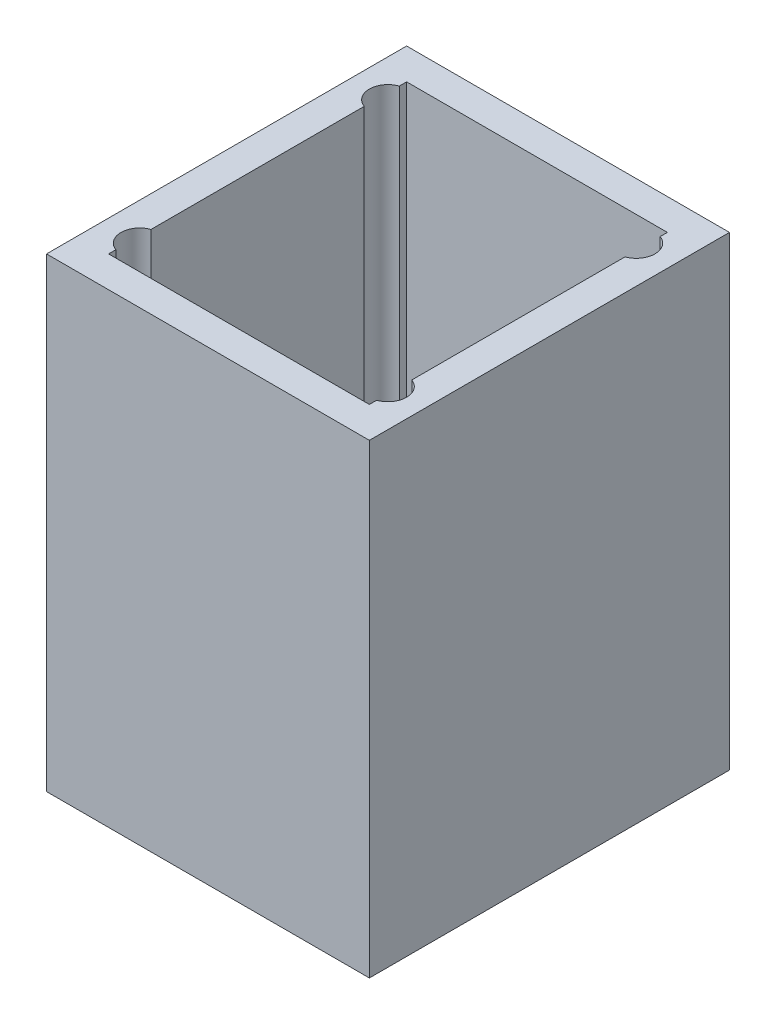
ISO-10303-21;
HEADER;
FILE_DESCRIPTION(('STEP AP214'),'2;1');
FILE_NAME('part.step','',(''),(''),'','','');
FILE_SCHEMA(('AUTOMOTIVE_DESIGN { 1 0 10303 214 1 1 1 1 }'));
ENDSEC;
DATA;
#1=APPLICATION_CONTEXT('core data for automotive mechanical design processes');
#2=APPLICATION_PROTOCOL_DEFINITION('international standard','automotive_design',2000,#1);
#3=PRODUCT_CONTEXT('',#1,'mechanical');
#4=PRODUCT('Part','Part','',(#3));
#5=PRODUCT_RELATED_PRODUCT_CATEGORY('part','',(#4));
#6=PRODUCT_DEFINITION_FORMATION('','',#4);
#7=PRODUCT_DEFINITION_CONTEXT('part definition',#1,'design');
#8=PRODUCT_DEFINITION('design','',#6,#7);
#9=PRODUCT_DEFINITION_SHAPE('','',#8);
#10=(LENGTH_UNIT() NAMED_UNIT(*) SI_UNIT(.MILLI.,.METRE.));
#11=(NAMED_UNIT(*) PLANE_ANGLE_UNIT() SI_UNIT($,.RADIAN.));
#12=(NAMED_UNIT(*) SI_UNIT($,.STERADIAN.) SOLID_ANGLE_UNIT());
#13=UNCERTAINTY_MEASURE_WITH_UNIT(LENGTH_MEASURE(1.E-05),#10,'distance_accuracy_value','');
#14=(GEOMETRIC_REPRESENTATION_CONTEXT(3) GLOBAL_UNCERTAINTY_ASSIGNED_CONTEXT((#13)) GLOBAL_UNIT_ASSIGNED_CONTEXT((#10,
#11,#12)) REPRESENTATION_CONTEXT('',''));
#15=CARTESIAN_POINT('',(0.,0.,0.));
#16=DIRECTION('',(0.,0.,1.));
#17=DIRECTION('',(1.,0.,0.));
#18=AXIS2_PLACEMENT_3D('',#15,#16,#17);
#19=CARTESIAN_POINT('',(0.,5.,0.));
#20=DIRECTION('',(0.,1.,0.));
#21=DIRECTION('',(0.,0.,1.));
#22=AXIS2_PLACEMENT_3D('',#19,#20,#21);
#23=PLANE('',#22);
#24=CARTESIAN_POINT('',(-20.,5.,-20.));
#25=DIRECTION('',(0.,1.,0.));
#26=DIRECTION('',(0.,0.,1.));
#27=AXIS2_PLACEMENT_3D('',#24,#25,#26);
#28=CIRCLE('',#27,3.);
#29=CARTESIAN_POINT('',(-21.,5.,-17.1715728752538));
#30=VERTEX_POINT('',#29);
#31=CARTESIAN_POINT('',(-21.,5.,-22.8284271247462));
#32=VERTEX_POINT('',#31);
#33=EDGE_CURVE('E325',#30,#32,#28,.T.);
#34=ORIENTED_EDGE('',*,*,#33,.F.);
#35=DIRECTION('',(0.,0.,1.));
#36=VECTOR('',#35,1.);
#37=CARTESIAN_POINT('',(-21.,5.,0.));
#38=LINE('',#37,#36);
#39=CARTESIAN_POINT('',(-21.,5.,17.1715728752538));
#40=VERTEX_POINT('',#39);
#41=EDGE_CURVE('E235',#30,#40,#38,.T.);
#42=ORIENTED_EDGE('',*,*,#41,.T.);
#43=CARTESIAN_POINT('',(-20.,5.,20.));
#44=DIRECTION('',(0.,1.,0.));
#45=DIRECTION('',(0.,0.,1.));
#46=AXIS2_PLACEMENT_3D('',#43,#44,#45);
#47=CIRCLE('',#46,3.);
#48=CARTESIAN_POINT('',(-21.,5.,22.8284271247462));
#49=VERTEX_POINT('',#48);
#50=EDGE_CURVE('E319',#49,#40,#47,.T.);
#51=ORIENTED_EDGE('',*,*,#50,.F.);
#52=CARTESIAN_POINT('',(-21.,5.,24.));
#53=VERTEX_POINT('',#52);
#54=EDGE_CURVE('E115',#49,#53,#38,.T.);
#55=ORIENTED_EDGE('',*,*,#54,.T.);
#56=DIRECTION('',(1.,0.,0.));
#57=VECTOR('',#56,1.);
#58=CARTESIAN_POINT('',(0.,5.,24.));
#59=LINE('',#58,#57);
#60=CARTESIAN_POINT('',(21.,5.,24.));
#61=VERTEX_POINT('',#60);
#62=EDGE_CURVE('E120',#53,#61,#59,.T.);
#63=ORIENTED_EDGE('',*,*,#62,.T.);
#64=DIRECTION('',(0.,0.,1.));
#65=VECTOR('',#64,1.);
#66=CARTESIAN_POINT('',(21.,5.,0.));
#67=LINE('',#66,#65);
#68=CARTESIAN_POINT('',(21.,5.,22.8284271247462));
#69=VERTEX_POINT('',#68);
#70=EDGE_CURVE('E270',#69,#61,#67,.T.);
#71=ORIENTED_EDGE('',*,*,#70,.F.);
#72=CARTESIAN_POINT('',(20.,5.,20.));
#73=DIRECTION('',(0.,1.,0.));
#74=DIRECTION('',(0.,0.,1.));
#75=AXIS2_PLACEMENT_3D('',#72,#73,#74);
#76=CIRCLE('',#75,3.);
#77=CARTESIAN_POINT('',(21.,5.,17.1715728752538));
#78=VERTEX_POINT('',#77);
#79=EDGE_CURVE('E313',#78,#69,#76,.T.);
#80=ORIENTED_EDGE('',*,*,#79,.F.);
#81=CARTESIAN_POINT('',(21.,5.,-17.1715728752538));
#82=VERTEX_POINT('',#81);
#83=EDGE_CURVE('E269',#82,#78,#67,.T.);
#84=ORIENTED_EDGE('',*,*,#83,.F.);
#85=CARTESIAN_POINT('',(20.,5.,-20.));
#86=DIRECTION('',(0.,1.,0.));
#87=DIRECTION('',(0.,0.,1.));
#88=AXIS2_PLACEMENT_3D('',#85,#86,#87);
#89=CIRCLE('',#88,3.);
#90=CARTESIAN_POINT('',(21.,5.,-22.8284271247462));
#91=VERTEX_POINT('',#90);
#92=EDGE_CURVE('E307',#91,#82,#89,.T.);
#93=ORIENTED_EDGE('',*,*,#92,.F.);
#94=CARTESIAN_POINT('',(21.,5.,-24.));
#95=VERTEX_POINT('',#94);
#96=EDGE_CURVE('E266',#95,#91,#67,.T.);
#97=ORIENTED_EDGE('',*,*,#96,.F.);
#98=DIRECTION('',(1.,0.,0.));
#99=VECTOR('',#98,1.);
#100=CARTESIAN_POINT('',(0.,5.,-24.));
#101=LINE('',#100,#99);
#102=CARTESIAN_POINT('',(-21.,5.,-24.));
#103=VERTEX_POINT('',#102);
#104=EDGE_CURVE('E263',#103,#95,#101,.T.);
#105=ORIENTED_EDGE('',*,*,#104,.F.);
#106=EDGE_CURVE('E233',#103,#32,#38,.T.);
#107=ORIENTED_EDGE('',*,*,#106,.T.);
#108=EDGE_LOOP('',(#34,#42,#51,#55,#63,#71,#80,#84,#93,#97,#105,#107));
#109=FACE_BOUND('',#108,.T.);
#110=ADVANCED_FACE('F100',(#109),#23,.T.);
#111=CARTESIAN_POINT('',(0.,2.,0.));
#112=DIRECTION('',(0.,1.,0.));
#113=DIRECTION('',(0.,0.,1.));
#114=AXIS2_PLACEMENT_3D('',#111,#112,#113);
#115=PLANE('',#114);
#116=CARTESIAN_POINT('',(-20.,2.,-20.));
#117=DIRECTION('',(0.,1.,0.));
#118=DIRECTION('',(0.,0.,1.));
#119=AXIS2_PLACEMENT_3D('',#116,#117,#118);
#120=CIRCLE('',#119,1.7);
#121=CARTESIAN_POINT('',(-20.,2.,-18.3));
#122=VERTEX_POINT('',#121);
#123=EDGE_CURVE('E349',#122,#122,#120,.T.);
#124=ORIENTED_EDGE('',*,*,#123,.F.);
#125=EDGE_LOOP('',(#124));
#126=FACE_BOUND('',#125,.T.);
#127=CARTESIAN_POINT('',(-20.,2.,-20.));
#128=DIRECTION('',(0.,1.,0.));
#129=DIRECTION('',(0.,0.,1.));
#130=AXIS2_PLACEMENT_3D('',#127,#128,#129);
#131=CIRCLE('',#130,3.);
#132=CARTESIAN_POINT('',(-20.,2.,-17.));
#133=VERTEX_POINT('',#132);
#134=EDGE_CURVE('E322',#133,#133,#131,.T.);
#135=ORIENTED_EDGE('',*,*,#134,.T.);
#136=EDGE_LOOP('',(#135));
#137=FACE_BOUND('',#136,.T.);
#138=ADVANCED_FACE('F387',(#126,#137),#115,.T.);
#139=CARTESIAN_POINT('',(-20.,2.,20.));
#140=DIRECTION('',(0.,1.,0.));
#141=DIRECTION('',(0.,0.,1.));
#142=AXIS2_PLACEMENT_3D('',#139,#140,#141);
#143=CIRCLE('',#142,1.7);
#144=CARTESIAN_POINT('',(-20.,2.,21.7));
#145=VERTEX_POINT('',#144);
#146=EDGE_CURVE('E343',#145,#145,#143,.T.);
#147=ORIENTED_EDGE('',*,*,#146,.F.);
#148=EDGE_LOOP('',(#147));
#149=FACE_BOUND('',#148,.T.);
#150=CARTESIAN_POINT('',(-20.,2.,20.));
#151=DIRECTION('',(0.,1.,0.));
#152=DIRECTION('',(0.,0.,1.));
#153=AXIS2_PLACEMENT_3D('',#150,#151,#152);
#154=CIRCLE('',#153,3.);
#155=CARTESIAN_POINT('',(-20.,2.,23.));
#156=VERTEX_POINT('',#155);
#157=EDGE_CURVE('E316',#156,#156,#154,.T.);
#158=ORIENTED_EDGE('',*,*,#157,.T.);
#159=EDGE_LOOP('',(#158));
#160=FACE_BOUND('',#159,.T.);
#161=ADVANCED_FACE('F392',(#149,#160),#115,.T.);
#162=CARTESIAN_POINT('',(20.,2.,20.));
#163=DIRECTION('',(0.,1.,0.));
#164=DIRECTION('',(0.,0.,-1.));
#165=AXIS2_PLACEMENT_3D('',#162,#163,#164);
#166=CIRCLE('',#165,1.7);
#167=CARTESIAN_POINT('',(20.,2.,18.3));
#168=VERTEX_POINT('',#167);
#169=EDGE_CURVE('E337',#168,#168,#166,.T.);
#170=ORIENTED_EDGE('',*,*,#169,.F.);
#171=EDGE_LOOP('',(#170));
#172=FACE_BOUND('',#171,.T.);
#173=CARTESIAN_POINT('',(20.,2.,20.));
#174=DIRECTION('',(0.,1.,0.));
#175=DIRECTION('',(0.,0.,1.));
#176=AXIS2_PLACEMENT_3D('',#173,#174,#175);
#177=CIRCLE('',#176,3.);
#178=CARTESIAN_POINT('',(20.,2.,23.));
#179=VERTEX_POINT('',#178);
#180=EDGE_CURVE('E310',#179,#179,#177,.T.);
#181=ORIENTED_EDGE('',*,*,#180,.T.);
#182=EDGE_LOOP('',(#181));
#183=FACE_BOUND('',#182,.T.);
#184=ADVANCED_FACE('F415',(#172,#183),#115,.T.);
#185=CARTESIAN_POINT('',(20.,2.,-20.));
#186=DIRECTION('',(0.,1.,0.));
#187=DIRECTION('',(0.,0.,-1.));
#188=AXIS2_PLACEMENT_3D('',#185,#186,#187);
#189=CIRCLE('',#188,1.7);
#190=CARTESIAN_POINT('',(20.,2.,-21.7));
#191=VERTEX_POINT('',#190);
#192=EDGE_CURVE('E331',#191,#191,#189,.T.);
#193=ORIENTED_EDGE('',*,*,#192,.F.);
#194=EDGE_LOOP('',(#193));
#195=FACE_BOUND('',#194,.T.);
#196=CARTESIAN_POINT('',(20.,2.,-20.));
#197=DIRECTION('',(0.,1.,0.));
#198=DIRECTION('',(0.,0.,1.));
#199=AXIS2_PLACEMENT_3D('',#196,#197,#198);
#200=CIRCLE('',#199,3.);
#201=CARTESIAN_POINT('',(20.,2.,-17.));
#202=VERTEX_POINT('',#201);
#203=EDGE_CURVE('E306',#202,#202,#200,.T.);
#204=ORIENTED_EDGE('',*,*,#203,.T.);
#205=EDGE_LOOP('',(#204));
#206=FACE_BOUND('',#205,.T.);
#207=ADVANCED_FACE('F395',(#195,#206),#115,.T.);
#208=CARTESIAN_POINT('',(0.,0.,0.));
#209=DIRECTION('',(0.,1.,0.));
#210=DIRECTION('',(0.,0.,1.));
#211=AXIS2_PLACEMENT_3D('',#208,#209,#210);
#212=PLANE('',#211);
#213=DIRECTION('',(0.,0.,-1.));
#214=VECTOR('',#213,1.);
#215=CARTESIAN_POINT('',(26.,0.,-29.));
#216=LINE('',#215,#214);
#217=CARTESIAN_POINT('',(26.,0.,29.));
#218=VERTEX_POINT('',#217);
#219=CARTESIAN_POINT('',(26.,0.,-29.));
#220=VERTEX_POINT('',#219);
#221=EDGE_CURVE('E217',#218,#220,#216,.T.);
#222=ORIENTED_EDGE('',*,*,#221,.F.);
#223=DIRECTION('',(1.,0.,0.));
#224=VECTOR('',#223,1.);
#225=CARTESIAN_POINT('',(-26.,0.,29.));
#226=LINE('',#225,#224);
#227=CARTESIAN_POINT('',(-26.,0.,29.));
#228=VERTEX_POINT('',#227);
#229=EDGE_CURVE('E359',#228,#218,#226,.T.);
#230=ORIENTED_EDGE('',*,*,#229,.F.);
#231=DIRECTION('',(0.,0.,1.));
#232=VECTOR('',#231,1.);
#233=CARTESIAN_POINT('',(-26.,0.,-29.));
#234=LINE('',#233,#232);
#235=CARTESIAN_POINT('',(-26.,0.,-29.));
#236=VERTEX_POINT('',#235);
#237=EDGE_CURVE('E357',#236,#228,#234,.T.);
#238=ORIENTED_EDGE('',*,*,#237,.F.);
#239=DIRECTION('',(-1.,0.,0.));
#240=VECTOR('',#239,1.);
#241=CARTESIAN_POINT('',(-26.,0.,-29.));
#242=LINE('',#241,#240);
#243=EDGE_CURVE('E355',#220,#236,#242,.T.);
#244=ORIENTED_EDGE('',*,*,#243,.F.);
#245=EDGE_LOOP('',(#222,#230,#238,#244));
#246=FACE_BOUND('',#245,.T.);
#247=CARTESIAN_POINT('',(-20.,0.,-20.));
#248=DIRECTION('',(0.,1.,0.));
#249=DIRECTION('',(0.,0.,1.));
#250=AXIS2_PLACEMENT_3D('',#247,#248,#249);
#251=CIRCLE('',#250,1.7);
#252=CARTESIAN_POINT('',(-20.,0.,-18.3));
#253=VERTEX_POINT('',#252);
#254=EDGE_CURVE('E346',#253,#253,#251,.T.);
#255=ORIENTED_EDGE('',*,*,#254,.T.);
#256=EDGE_LOOP('',(#255));
#257=FACE_BOUND('',#256,.T.);
#258=CARTESIAN_POINT('',(-20.,0.,20.));
#259=DIRECTION('',(0.,1.,0.));
#260=DIRECTION('',(0.,0.,1.));
#261=AXIS2_PLACEMENT_3D('',#258,#259,#260);
#262=CIRCLE('',#261,1.7);
#263=CARTESIAN_POINT('',(-20.,0.,21.7));
#264=VERTEX_POINT('',#263);
#265=EDGE_CURVE('E340',#264,#264,#262,.T.);
#266=ORIENTED_EDGE('',*,*,#265,.T.);
#267=EDGE_LOOP('',(#266));
#268=FACE_BOUND('',#267,.T.);
#269=CARTESIAN_POINT('',(20.,0.,20.));
#270=DIRECTION('',(0.,1.,0.));
#271=DIRECTION('',(0.,0.,-1.));
#272=AXIS2_PLACEMENT_3D('',#269,#270,#271);
#273=CIRCLE('',#272,1.7);
#274=CARTESIAN_POINT('',(20.,0.,18.3));
#275=VERTEX_POINT('',#274);
#276=EDGE_CURVE('E334',#275,#275,#273,.T.);
#277=ORIENTED_EDGE('',*,*,#276,.T.);
#278=EDGE_LOOP('',(#277));
#279=FACE_BOUND('',#278,.T.);
#280=CARTESIAN_POINT('',(20.,0.,-20.));
#281=DIRECTION('',(0.,1.,0.));
#282=DIRECTION('',(0.,0.,-1.));
#283=AXIS2_PLACEMENT_3D('',#280,#281,#282);
#284=CIRCLE('',#283,1.7);
#285=CARTESIAN_POINT('',(20.,0.,-21.7));
#286=VERTEX_POINT('',#285);
#287=EDGE_CURVE('E328',#286,#286,#284,.T.);
#288=ORIENTED_EDGE('',*,*,#287,.T.);
#289=EDGE_LOOP('',(#288));
#290=FACE_BOUND('',#289,.T.);
#291=ADVANCED_FACE('F370',(#246,#257,#268,#279,#290),#212,.F.);
#292=CARTESIAN_POINT('',(26.,2.,-29.));
#293=DIRECTION('',(-1.,0.,0.));
#294=DIRECTION('',(0.,0.,1.));
#295=AXIS2_PLACEMENT_3D('',#292,#293,#294);
#296=PLANE('',#295);
#297=ORIENTED_EDGE('',*,*,#221,.T.);
#298=DIRECTION('',(0.,-1.,0.));
#299=VECTOR('',#298,1.);
#300=CARTESIAN_POINT('',(26.,2.,-29.));
#301=LINE('',#300,#299);
#302=CARTESIAN_POINT('',(26.,75.,-29.));
#303=VERTEX_POINT('',#302);
#304=EDGE_CURVE('E12',#303,#220,#301,.T.);
#305=ORIENTED_EDGE('',*,*,#304,.F.);
#306=DIRECTION('',(0.,0.,-1.));
#307=VECTOR('',#306,1.);
#308=CARTESIAN_POINT('',(26.,75.,0.));
#309=LINE('',#308,#307);
#310=CARTESIAN_POINT('',(26.,75.,29.));
#311=VERTEX_POINT('',#310);
#312=EDGE_CURVE('E215',#311,#303,#309,.T.);
#313=ORIENTED_EDGE('',*,*,#312,.F.);
#314=DIRECTION('',(0.,-1.,0.));
#315=VECTOR('',#314,1.);
#316=CARTESIAN_POINT('',(26.,2.,29.));
#317=LINE('',#316,#315);
#318=EDGE_CURVE('E361',#311,#218,#317,.T.);
#319=ORIENTED_EDGE('',*,*,#318,.T.);
#320=EDGE_LOOP('',(#297,#305,#313,#319));
#321=FACE_BOUND('',#320,.T.);
#322=ADVANCED_FACE('F102',(#321),#296,.F.);
#323=CARTESIAN_POINT('',(-26.,2.,-29.));
#324=DIRECTION('',(0.,0.,1.));
#325=DIRECTION('',(1.,0.,0.));
#326=AXIS2_PLACEMENT_3D('',#323,#324,#325);
#327=PLANE('',#326);
#328=ORIENTED_EDGE('',*,*,#243,.T.);
#329=DIRECTION('',(0.,-1.,0.));
#330=VECTOR('',#329,1.);
#331=CARTESIAN_POINT('',(-26.,2.,-29.));
#332=LINE('',#331,#330);
#333=CARTESIAN_POINT('',(-26.,75.,-29.));
#334=VERTEX_POINT('',#333);
#335=EDGE_CURVE('E108',#334,#236,#332,.T.);
#336=ORIENTED_EDGE('',*,*,#335,.F.);
#337=DIRECTION('',(-1.,0.,0.));
#338=VECTOR('',#337,1.);
#339=CARTESIAN_POINT('',(0.,75.,-29.));
#340=LINE('',#339,#338);
#341=EDGE_CURVE('E220',#303,#334,#340,.T.);
#342=ORIENTED_EDGE('',*,*,#341,.F.);
#343=ORIENTED_EDGE('',*,*,#304,.T.);
#344=EDGE_LOOP('',(#328,#336,#342,#343));
#345=FACE_BOUND('',#344,.T.);
#346=ADVANCED_FACE('F221',(#345),#327,.F.);
#347=CARTESIAN_POINT('',(-26.,2.,-29.));
#348=DIRECTION('',(1.,0.,0.));
#349=DIRECTION('',(0.,0.,-1.));
#350=AXIS2_PLACEMENT_3D('',#347,#348,#349);
#351=PLANE('',#350);
#352=ORIENTED_EDGE('',*,*,#237,.T.);
#353=DIRECTION('',(0.,-1.,0.));
#354=VECTOR('',#353,1.);
#355=CARTESIAN_POINT('',(-26.,2.,29.));
#356=LINE('',#355,#354);
#357=CARTESIAN_POINT('',(-26.,75.,29.));
#358=VERTEX_POINT('',#357);
#359=EDGE_CURVE('E363',#358,#228,#356,.T.);
#360=ORIENTED_EDGE('',*,*,#359,.F.);
#361=DIRECTION('',(0.,0.,1.));
#362=VECTOR('',#361,1.);
#363=CARTESIAN_POINT('',(-26.,75.,0.));
#364=LINE('',#363,#362);
#365=EDGE_CURVE('E226',#334,#358,#364,.T.);
#366=ORIENTED_EDGE('',*,*,#365,.F.);
#367=ORIENTED_EDGE('',*,*,#335,.T.);
#368=EDGE_LOOP('',(#352,#360,#366,#367));
#369=FACE_BOUND('',#368,.T.);
#370=ADVANCED_FACE('F367',(#369),#351,.F.);
#371=CARTESIAN_POINT('',(-26.,2.,29.));
#372=DIRECTION('',(0.,0.,-1.));
#373=DIRECTION('',(-1.,0.,0.));
#374=AXIS2_PLACEMENT_3D('',#371,#372,#373);
#375=PLANE('',#374);
#376=ORIENTED_EDGE('',*,*,#229,.T.);
#377=ORIENTED_EDGE('',*,*,#318,.F.);
#378=DIRECTION('',(1.,0.,0.));
#379=VECTOR('',#378,1.);
#380=CARTESIAN_POINT('',(0.,75.,29.));
#381=LINE('',#380,#379);
#382=EDGE_CURVE('E232',#358,#311,#381,.T.);
#383=ORIENTED_EDGE('',*,*,#382,.F.);
#384=ORIENTED_EDGE('',*,*,#359,.T.);
#385=EDGE_LOOP('',(#376,#377,#383,#384));
#386=FACE_BOUND('',#385,.T.);
#387=ADVANCED_FACE('F373',(#386),#375,.F.);
#388=CARTESIAN_POINT('',(-20.,2.,-20.));
#389=DIRECTION('',(0.,-1.,0.));
#390=DIRECTION('',(0.,0.,-1.));
#391=AXIS2_PLACEMENT_3D('',#388,#389,#390);
#392=CYLINDRICAL_SURFACE('',#391,1.7);
#393=ORIENTED_EDGE('',*,*,#123,.T.);
#394=EDGE_LOOP('',(#393));
#395=FACE_BOUND('',#394,.T.);
#396=ORIENTED_EDGE('',*,*,#254,.F.);
#397=EDGE_LOOP('',(#396));
#398=FACE_BOUND('',#397,.T.);
#399=ADVANCED_FACE('F375',(#395,#398),#392,.F.);
#400=CARTESIAN_POINT('',(-20.,2.,20.));
#401=DIRECTION('',(0.,-1.,0.));
#402=DIRECTION('',(0.,0.,-1.));
#403=AXIS2_PLACEMENT_3D('',#400,#401,#402);
#404=CYLINDRICAL_SURFACE('',#403,1.7);
#405=ORIENTED_EDGE('',*,*,#146,.T.);
#406=EDGE_LOOP('',(#405));
#407=FACE_BOUND('',#406,.T.);
#408=ORIENTED_EDGE('',*,*,#265,.F.);
#409=EDGE_LOOP('',(#408));
#410=FACE_BOUND('',#409,.T.);
#411=ADVANCED_FACE('F381',(#407,#410),#404,.F.);
#412=CARTESIAN_POINT('',(20.,2.,20.));
#413=DIRECTION('',(0.,-1.,0.));
#414=DIRECTION('',(0.,0.,-1.));
#415=AXIS2_PLACEMENT_3D('',#412,#413,#414);
#416=CYLINDRICAL_SURFACE('',#415,1.7);
#417=ORIENTED_EDGE('',*,*,#169,.T.);
#418=EDGE_LOOP('',(#417));
#419=FACE_BOUND('',#418,.T.);
#420=ORIENTED_EDGE('',*,*,#276,.F.);
#421=EDGE_LOOP('',(#420));
#422=FACE_BOUND('',#421,.T.);
#423=ADVANCED_FACE('F403',(#419,#422),#416,.F.);
#424=CARTESIAN_POINT('',(20.,2.,-20.));
#425=DIRECTION('',(0.,-1.,0.));
#426=DIRECTION('',(0.,0.,-1.));
#427=AXIS2_PLACEMENT_3D('',#424,#425,#426);
#428=CYLINDRICAL_SURFACE('',#427,1.7);
#429=ORIENTED_EDGE('',*,*,#192,.T.);
#430=EDGE_LOOP('',(#429));
#431=FACE_BOUND('',#430,.T.);
#432=ORIENTED_EDGE('',*,*,#287,.F.);
#433=EDGE_LOOP('',(#432));
#434=FACE_BOUND('',#433,.T.);
#435=ADVANCED_FACE('F400',(#431,#434),#428,.F.);
#436=CARTESIAN_POINT('',(-20.,5.,-20.));
#437=DIRECTION('',(0.,-1.,0.));
#438=DIRECTION('',(0.,0.,-1.));
#439=AXIS2_PLACEMENT_3D('',#436,#437,#438);
#440=CYLINDRICAL_SURFACE('',#439,3.);
#441=ORIENTED_EDGE('',*,*,#33,.T.);
#442=DIRECTION('',(0.,-1.,0.));
#443=VECTOR('',#442,1.);
#444=CARTESIAN_POINT('',(-21.,75.,-22.8284271247462));
#445=LINE('',#444,#443);
#446=CARTESIAN_POINT('',(-21.,75.,-22.8284271247462));
#447=VERTEX_POINT('',#446);
#448=EDGE_CURVE('E275',#447,#32,#445,.T.);
#449=ORIENTED_EDGE('',*,*,#448,.F.);
#450=CARTESIAN_POINT('',(-20.,75.,-20.));
#451=DIRECTION('',(0.,1.,0.));
#452=DIRECTION('',(0.,0.,1.));
#453=AXIS2_PLACEMENT_3D('',#450,#451,#452);
#454=CIRCLE('',#453,3.);
#455=CARTESIAN_POINT('',(-21.,75.,-17.1715728752538));
#456=VERTEX_POINT('',#455);
#457=EDGE_CURVE('E261',#456,#447,#454,.F.);
#458=ORIENTED_EDGE('',*,*,#457,.F.);
#459=DIRECTION('',(0.,-1.,0.));
#460=VECTOR('',#459,1.);
#461=CARTESIAN_POINT('',(-21.,75.,-17.1715728752538));
#462=LINE('',#461,#460);
#463=EDGE_CURVE('E278',#456,#30,#462,.T.);
#464=ORIENTED_EDGE('',*,*,#463,.T.);
#465=EDGE_LOOP('',(#441,#449,#458,#464));
#466=FACE_BOUND('',#465,.T.);
#467=ORIENTED_EDGE('',*,*,#134,.F.);
#468=EDGE_LOOP('',(#467));
#469=FACE_BOUND('',#468,.T.);
#470=ADVANCED_FACE('F398',(#466,#469),#440,.F.);
#471=CARTESIAN_POINT('',(-20.,5.,20.));
#472=DIRECTION('',(0.,-1.,0.));
#473=DIRECTION('',(0.,0.,-1.));
#474=AXIS2_PLACEMENT_3D('',#471,#472,#473);
#475=CYLINDRICAL_SURFACE('',#474,3.);
#476=ORIENTED_EDGE('',*,*,#50,.T.);
#477=DIRECTION('',(0.,-1.,0.));
#478=VECTOR('',#477,1.);
#479=CARTESIAN_POINT('',(-21.,75.,17.1715728752538));
#480=LINE('',#479,#478);
#481=CARTESIAN_POINT('',(-21.,75.,17.1715728752538));
#482=VERTEX_POINT('',#481);
#483=EDGE_CURVE('E281',#482,#40,#480,.T.);
#484=ORIENTED_EDGE('',*,*,#483,.F.);
#485=CARTESIAN_POINT('',(-20.,75.,20.));
#486=DIRECTION('',(0.,1.,0.));
#487=DIRECTION('',(0.,0.,1.));
#488=AXIS2_PLACEMENT_3D('',#485,#486,#487);
#489=CIRCLE('',#488,3.);
#490=CARTESIAN_POINT('',(-21.,75.,22.8284271247462));
#491=VERTEX_POINT('',#490);
#492=EDGE_CURVE('E257',#491,#482,#489,.F.);
#493=ORIENTED_EDGE('',*,*,#492,.F.);
#494=DIRECTION('',(0.,-1.,0.));
#495=VECTOR('',#494,1.);
#496=CARTESIAN_POINT('',(-21.,75.,22.8284271247462));
#497=LINE('',#496,#495);
#498=EDGE_CURVE('E284',#491,#49,#497,.T.);
#499=ORIENTED_EDGE('',*,*,#498,.T.);
#500=EDGE_LOOP('',(#476,#484,#493,#499));
#501=FACE_BOUND('',#500,.T.);
#502=ORIENTED_EDGE('',*,*,#157,.F.);
#503=EDGE_LOOP('',(#502));
#504=FACE_BOUND('',#503,.T.);
#505=ADVANCED_FACE('F438',(#501,#504),#475,.F.);
#506=CARTESIAN_POINT('',(20.,5.,20.));
#507=DIRECTION('',(0.,-1.,0.));
#508=DIRECTION('',(0.,0.,-1.));
#509=AXIS2_PLACEMENT_3D('',#506,#507,#508);
#510=CYLINDRICAL_SURFACE('',#509,3.);
#511=ORIENTED_EDGE('',*,*,#79,.T.);
#512=DIRECTION('',(0.,-1.,0.));
#513=VECTOR('',#512,1.);
#514=CARTESIAN_POINT('',(21.,75.,22.8284271247462));
#515=LINE('',#514,#513);
#516=CARTESIAN_POINT('',(21.,75.,22.8284271247462));
#517=VERTEX_POINT('',#516);
#518=EDGE_CURVE('E291',#517,#69,#515,.T.);
#519=ORIENTED_EDGE('',*,*,#518,.F.);
#520=CARTESIAN_POINT('',(20.,75.,20.));
#521=DIRECTION('',(0.,1.,0.));
#522=DIRECTION('',(0.,0.,1.));
#523=AXIS2_PLACEMENT_3D('',#520,#521,#522);
#524=CIRCLE('',#523,3.);
#525=CARTESIAN_POINT('',(21.,75.,17.1715728752538));
#526=VERTEX_POINT('',#525);
#527=EDGE_CURVE('E249',#526,#517,#524,.F.);
#528=ORIENTED_EDGE('',*,*,#527,.F.);
#529=DIRECTION('',(0.,-1.,0.));
#530=VECTOR('',#529,1.);
#531=CARTESIAN_POINT('',(21.,75.,17.1715728752538));
#532=LINE('',#531,#530);
#533=EDGE_CURVE('E294',#526,#78,#532,.T.);
#534=ORIENTED_EDGE('',*,*,#533,.T.);
#535=EDGE_LOOP('',(#511,#519,#528,#534));
#536=FACE_BOUND('',#535,.T.);
#537=ORIENTED_EDGE('',*,*,#180,.F.);
#538=EDGE_LOOP('',(#537));
#539=FACE_BOUND('',#538,.T.);
#540=ADVANCED_FACE('F428',(#536,#539),#510,.F.);
#541=CARTESIAN_POINT('',(20.,5.,-20.));
#542=DIRECTION('',(0.,-1.,0.));
#543=DIRECTION('',(0.,0.,-1.));
#544=AXIS2_PLACEMENT_3D('',#541,#542,#543);
#545=CYLINDRICAL_SURFACE('',#544,3.);
#546=ORIENTED_EDGE('',*,*,#92,.T.);
#547=DIRECTION('',(0.,-1.,0.));
#548=VECTOR('',#547,1.);
#549=CARTESIAN_POINT('',(21.,75.,-17.1715728752538));
#550=LINE('',#549,#548);
#551=CARTESIAN_POINT('',(21.,75.,-17.1715728752538));
#552=VERTEX_POINT('',#551);
#553=EDGE_CURVE('E297',#552,#82,#550,.T.);
#554=ORIENTED_EDGE('',*,*,#553,.F.);
#555=CARTESIAN_POINT('',(20.,75.,-20.));
#556=DIRECTION('',(0.,1.,0.));
#557=DIRECTION('',(0.,0.,1.));
#558=AXIS2_PLACEMENT_3D('',#555,#556,#557);
#559=CIRCLE('',#558,3.);
#560=CARTESIAN_POINT('',(21.,75.,-22.8284271247462));
#561=VERTEX_POINT('',#560);
#562=EDGE_CURVE('E245',#561,#552,#559,.F.);
#563=ORIENTED_EDGE('',*,*,#562,.F.);
#564=DIRECTION('',(0.,-1.,0.));
#565=VECTOR('',#564,1.);
#566=CARTESIAN_POINT('',(21.,75.,-22.8284271247462));
#567=LINE('',#566,#565);
#568=EDGE_CURVE('E300',#561,#91,#567,.T.);
#569=ORIENTED_EDGE('',*,*,#568,.T.);
#570=EDGE_LOOP('',(#546,#554,#563,#569));
#571=FACE_BOUND('',#570,.T.);
#572=ORIENTED_EDGE('',*,*,#203,.F.);
#573=EDGE_LOOP('',(#572));
#574=FACE_BOUND('',#573,.T.);
#575=ADVANCED_FACE('F425',(#571,#574),#545,.F.);
#576=CARTESIAN_POINT('',(0.,75.,-24.));
#577=DIRECTION('',(0.,0.,-1.));
#578=DIRECTION('',(-1.,0.,0.));
#579=AXIS2_PLACEMENT_3D('',#576,#577,#578);
#580=PLANE('',#579);
#581=ORIENTED_EDGE('',*,*,#104,.T.);
#582=DIRECTION('',(0.,-1.,0.));
#583=VECTOR('',#582,1.);
#584=CARTESIAN_POINT('',(21.,75.,-24.));
#585=LINE('',#584,#583);
#586=CARTESIAN_POINT('',(21.,75.,-24.));
#587=VERTEX_POINT('',#586);
#588=EDGE_CURVE('E303',#587,#95,#585,.T.);
#589=ORIENTED_EDGE('',*,*,#588,.F.);
#590=DIRECTION('',(1.,0.,0.));
#591=VECTOR('',#590,1.);
#592=CARTESIAN_POINT('',(0.,75.,-24.));
#593=LINE('',#592,#591);
#594=CARTESIAN_POINT('',(-21.,75.,-24.));
#595=VERTEX_POINT('',#594);
#596=EDGE_CURVE('E240',#595,#587,#593,.T.);
#597=ORIENTED_EDGE('',*,*,#596,.F.);
#598=DIRECTION('',(0.,-1.,0.));
#599=VECTOR('',#598,1.);
#600=CARTESIAN_POINT('',(-21.,75.,-24.));
#601=LINE('',#600,#599);
#602=EDGE_CURVE('E272',#595,#103,#601,.T.);
#603=ORIENTED_EDGE('',*,*,#602,.T.);
#604=EDGE_LOOP('',(#581,#589,#597,#603));
#605=FACE_BOUND('',#604,.T.);
#606=ADVANCED_FACE('F427',(#605),#580,.F.);
#607=CARTESIAN_POINT('',(21.,75.,0.));
#608=DIRECTION('',(1.,0.,0.));
#609=DIRECTION('',(0.,0.,-1.));
#610=AXIS2_PLACEMENT_3D('',#607,#608,#609);
#611=PLANE('',#610);
#612=ORIENTED_EDGE('',*,*,#96,.T.);
#613=ORIENTED_EDGE('',*,*,#568,.F.);
#614=DIRECTION('',(0.,0.,1.));
#615=VECTOR('',#614,1.);
#616=CARTESIAN_POINT('',(21.,75.,0.));
#617=LINE('',#616,#615);
#618=EDGE_CURVE('E243',#587,#561,#617,.T.);
#619=ORIENTED_EDGE('',*,*,#618,.F.);
#620=ORIENTED_EDGE('',*,*,#588,.T.);
#621=EDGE_LOOP('',(#612,#613,#619,#620));
#622=FACE_BOUND('',#621,.T.);
#623=ADVANCED_FACE('F435',(#622),#611,.F.);
#624=ORIENTED_EDGE('',*,*,#83,.T.);
#625=ORIENTED_EDGE('',*,*,#533,.F.);
#626=EDGE_CURVE('E247',#552,#526,#617,.T.);
#627=ORIENTED_EDGE('',*,*,#626,.F.);
#628=ORIENTED_EDGE('',*,*,#553,.T.);
#629=EDGE_LOOP('',(#624,#625,#627,#628));
#630=FACE_BOUND('',#629,.T.);
#631=ADVANCED_FACE('F549',(#630),#611,.F.);
#632=ORIENTED_EDGE('',*,*,#70,.T.);
#633=DIRECTION('',(0.,-1.,0.));
#634=VECTOR('',#633,1.);
#635=CARTESIAN_POINT('',(21.,75.,24.));
#636=LINE('',#635,#634);
#637=CARTESIAN_POINT('',(21.,75.,24.));
#638=VERTEX_POINT('',#637);
#639=EDGE_CURVE('E289',#638,#61,#636,.T.);
#640=ORIENTED_EDGE('',*,*,#639,.F.);
#641=EDGE_CURVE('E246',#517,#638,#617,.T.);
#642=ORIENTED_EDGE('',*,*,#641,.F.);
#643=ORIENTED_EDGE('',*,*,#518,.T.);
#644=EDGE_LOOP('',(#632,#640,#642,#643));
#645=FACE_BOUND('',#644,.T.);
#646=ADVANCED_FACE('F551',(#645),#611,.F.);
#647=CARTESIAN_POINT('',(0.,75.,24.));
#648=DIRECTION('',(0.,0.,-1.));
#649=DIRECTION('',(-1.,0.,0.));
#650=AXIS2_PLACEMENT_3D('',#647,#648,#649);
#651=PLANE('',#650);
#652=ORIENTED_EDGE('',*,*,#62,.F.);
#653=DIRECTION('',(0.,-1.,0.));
#654=VECTOR('',#653,1.);
#655=CARTESIAN_POINT('',(-21.,75.,24.));
#656=LINE('',#655,#654);
#657=CARTESIAN_POINT('',(-21.,75.,24.));
#658=VERTEX_POINT('',#657);
#659=EDGE_CURVE('E287',#658,#53,#656,.T.);
#660=ORIENTED_EDGE('',*,*,#659,.F.);
#661=DIRECTION('',(1.,0.,0.));
#662=VECTOR('',#661,1.);
#663=CARTESIAN_POINT('',(0.,75.,24.));
#664=LINE('',#663,#662);
#665=EDGE_CURVE('E251',#658,#638,#664,.T.);
#666=ORIENTED_EDGE('',*,*,#665,.T.);
#667=ORIENTED_EDGE('',*,*,#639,.T.);
#668=EDGE_LOOP('',(#652,#660,#666,#667));
#669=FACE_BOUND('',#668,.T.);
#670=ADVANCED_FACE('F569',(#669),#651,.T.);
#671=CARTESIAN_POINT('',(-21.,75.,0.));
#672=DIRECTION('',(1.,0.,0.));
#673=DIRECTION('',(0.,0.,-1.));
#674=AXIS2_PLACEMENT_3D('',#671,#672,#673);
#675=PLANE('',#674);
#676=ORIENTED_EDGE('',*,*,#54,.F.);
#677=ORIENTED_EDGE('',*,*,#498,.F.);
#678=DIRECTION('',(0.,0.,1.));
#679=VECTOR('',#678,1.);
#680=CARTESIAN_POINT('',(-21.,75.,0.));
#681=LINE('',#680,#679);
#682=EDGE_CURVE('E254',#491,#658,#681,.T.);
#683=ORIENTED_EDGE('',*,*,#682,.T.);
#684=ORIENTED_EDGE('',*,*,#659,.T.);
#685=EDGE_LOOP('',(#676,#677,#683,#684));
#686=FACE_BOUND('',#685,.T.);
#687=ADVANCED_FACE('F579',(#686),#675,.T.);
#688=ORIENTED_EDGE('',*,*,#41,.F.);
#689=ORIENTED_EDGE('',*,*,#463,.F.);
#690=EDGE_CURVE('E259',#456,#482,#681,.T.);
#691=ORIENTED_EDGE('',*,*,#690,.T.);
#692=ORIENTED_EDGE('',*,*,#483,.T.);
#693=EDGE_LOOP('',(#688,#689,#691,#692));
#694=FACE_BOUND('',#693,.T.);
#695=ADVANCED_FACE('F590',(#694),#675,.T.);
#696=ORIENTED_EDGE('',*,*,#106,.F.);
#697=ORIENTED_EDGE('',*,*,#602,.F.);
#698=EDGE_CURVE('E258',#595,#447,#681,.T.);
#699=ORIENTED_EDGE('',*,*,#698,.T.);
#700=ORIENTED_EDGE('',*,*,#448,.T.);
#701=EDGE_LOOP('',(#696,#697,#699,#700));
#702=FACE_BOUND('',#701,.T.);
#703=ADVANCED_FACE('F593',(#702),#675,.T.);
#704=CARTESIAN_POINT('',(0.,75.,0.));
#705=DIRECTION('',(0.,1.,0.));
#706=DIRECTION('',(0.,0.,1.));
#707=AXIS2_PLACEMENT_3D('',#704,#705,#706);
#708=PLANE('',#707);
#709=ORIENTED_EDGE('',*,*,#312,.T.);
#710=ORIENTED_EDGE('',*,*,#341,.T.);
#711=ORIENTED_EDGE('',*,*,#365,.T.);
#712=ORIENTED_EDGE('',*,*,#382,.T.);
#713=EDGE_LOOP('',(#709,#710,#711,#712));
#714=FACE_BOUND('',#713,.T.);
#715=ORIENTED_EDGE('',*,*,#596,.T.);
#716=ORIENTED_EDGE('',*,*,#618,.T.);
#717=ORIENTED_EDGE('',*,*,#562,.T.);
#718=ORIENTED_EDGE('',*,*,#626,.T.);
#719=ORIENTED_EDGE('',*,*,#527,.T.);
#720=ORIENTED_EDGE('',*,*,#641,.T.);
#721=ORIENTED_EDGE('',*,*,#665,.F.);
#722=ORIENTED_EDGE('',*,*,#682,.F.);
#723=ORIENTED_EDGE('',*,*,#492,.T.);
#724=ORIENTED_EDGE('',*,*,#690,.F.);
#725=ORIENTED_EDGE('',*,*,#457,.T.);
#726=ORIENTED_EDGE('',*,*,#698,.F.);
#727=EDGE_LOOP('',(#715,#716,#717,#718,#719,#720,#721,#722,#723,#724,#725,#726));
#728=FACE_BOUND('',#727,.T.);
#729=ADVANCED_FACE('F229',(#714,#728),#708,.T.);
#730=CLOSED_SHELL('',(#110,#138,#161,#184,#207,#291,#322,#346,#370,#387,#399,#411,#423,#435,
#470,#505,#540,#575,#606,#623,#631,#646,#670,#687,#695,#703,#729));
#731=MANIFOLD_SOLID_BREP('B2',#730);
#732=ADVANCED_BREP_SHAPE_REPRESENTATION('',(#18,#731),#14);
#733=SHAPE_DEFINITION_REPRESENTATION(#9,#732);
ENDSEC;
END-ISO-10303-21;
